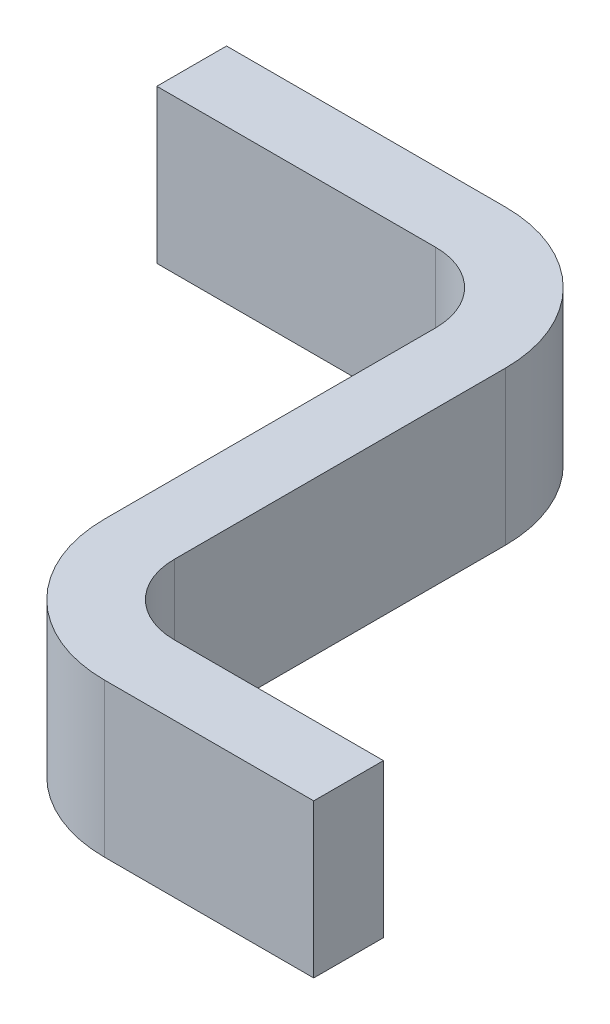
ISO-10303-21;
HEADER;
FILE_DESCRIPTION(('STEP AP214'),'2;1');
FILE_NAME('part.step','',(''),(''),'','','');
FILE_SCHEMA(('AUTOMOTIVE_DESIGN { 1 0 10303 214 1 1 1 1 }'));
ENDSEC;
DATA;
#1=APPLICATION_CONTEXT('core data for automotive mechanical design processes');
#2=APPLICATION_PROTOCOL_DEFINITION('international standard','automotive_design',2000,#1);
#3=PRODUCT_CONTEXT('',#1,'mechanical');
#4=PRODUCT('Part','Part','',(#3));
#5=PRODUCT_RELATED_PRODUCT_CATEGORY('part','',(#4));
#6=PRODUCT_DEFINITION_FORMATION('','',#4);
#7=PRODUCT_DEFINITION_CONTEXT('part definition',#1,'design');
#8=PRODUCT_DEFINITION('design','',#6,#7);
#9=PRODUCT_DEFINITION_SHAPE('','',#8);
#10=(LENGTH_UNIT() NAMED_UNIT(*) SI_UNIT(.MILLI.,.METRE.));
#11=(NAMED_UNIT(*) PLANE_ANGLE_UNIT() SI_UNIT($,.RADIAN.));
#12=(NAMED_UNIT(*) SI_UNIT($,.STERADIAN.) SOLID_ANGLE_UNIT());
#13=UNCERTAINTY_MEASURE_WITH_UNIT(LENGTH_MEASURE(1.E-05),#10,'distance_accuracy_value','');
#14=(GEOMETRIC_REPRESENTATION_CONTEXT(3) GLOBAL_UNCERTAINTY_ASSIGNED_CONTEXT((#13)) GLOBAL_UNIT_ASSIGNED_CONTEXT((#10,
#11,#12)) REPRESENTATION_CONTEXT('',''));
#15=CARTESIAN_POINT('',(0.,0.,0.));
#16=DIRECTION('',(0.,0.,1.));
#17=DIRECTION('',(1.,0.,0.));
#18=AXIS2_PLACEMENT_3D('',#15,#16,#17);
#19=CARTESIAN_POINT('',(-4.,1.36,0.675));
#20=DIRECTION('',(0.,-1.,0.));
#21=DIRECTION('',(1.,0.,0.));
#22=AXIS2_PLACEMENT_3D('',#19,#20,#21);
#23=PLANE('',#22);
#24=CARTESIAN_POINT('',(-3.8,1.36,0.675));
#25=DIRECTION('',(0.,1.,0.));
#26=DIRECTION('',(-1.,0.,0.));
#27=AXIS2_PLACEMENT_3D('',#24,#25,#26);
#28=CIRCLE('',#27,0.2);
#29=CARTESIAN_POINT('',(-3.8,1.36,0.875));
#30=VERTEX_POINT('',#29);
#31=CARTESIAN_POINT('',(-4.,1.36,0.675));
#32=VERTEX_POINT('',#31);
#33=EDGE_CURVE('E150',#30,#32,#28,.F.);
#34=ORIENTED_EDGE('',*,*,#33,.F.);
#35=DIRECTION('',(-1.,0.,0.));
#36=VECTOR('',#35,1.);
#37=CARTESIAN_POINT('',(-3.5,1.36,0.875));
#38=LINE('',#37,#36);
#39=CARTESIAN_POINT('',(-3.5,1.36,0.875));
#40=VERTEX_POINT('',#39);
#41=EDGE_CURVE('E147',#30,#40,#38,.F.);
#42=ORIENTED_EDGE('',*,*,#41,.T.);
#43=DIRECTION('',(0.,0.,1.));
#44=VECTOR('',#43,1.);
#45=CARTESIAN_POINT('',(-3.5,1.36,0.775));
#46=LINE('',#45,#44);
#47=CARTESIAN_POINT('',(-3.5,1.36,0.775));
#48=VERTEX_POINT('',#47);
#49=EDGE_CURVE('E141',#48,#40,#46,.T.);
#50=ORIENTED_EDGE('',*,*,#49,.F.);
#51=DIRECTION('',(1.,0.,0.));
#52=VECTOR('',#51,1.);
#53=CARTESIAN_POINT('',(-3.5,1.36,0.775));
#54=LINE('',#53,#52);
#55=CARTESIAN_POINT('',(-3.8,1.36,0.775));
#56=VERTEX_POINT('',#55);
#57=EDGE_CURVE('E115',#48,#56,#54,.F.);
#58=ORIENTED_EDGE('',*,*,#57,.T.);
#59=CARTESIAN_POINT('',(-3.8,1.36,0.675));
#60=DIRECTION('',(0.,1.,0.));
#61=DIRECTION('',(-1.,0.,0.));
#62=AXIS2_PLACEMENT_3D('',#59,#60,#61);
#63=CIRCLE('',#62,0.1);
#64=CARTESIAN_POINT('',(-3.9,1.36,0.675));
#65=VERTEX_POINT('',#64);
#66=EDGE_CURVE('E215',#56,#65,#63,.F.);
#67=ORIENTED_EDGE('',*,*,#66,.T.);
#68=DIRECTION('',(0.,0.,1.));
#69=VECTOR('',#68,1.);
#70=CARTESIAN_POINT('',(-3.9,1.36,0.675));
#71=LINE('',#70,#69);
#72=CARTESIAN_POINT('',(-3.9,1.36,0.2));
#73=VERTEX_POINT('',#72);
#74=EDGE_CURVE('E181',#65,#73,#71,.F.);
#75=ORIENTED_EDGE('',*,*,#74,.T.);
#76=CARTESIAN_POINT('',(-4.1,1.36,0.2));
#77=DIRECTION('',(0.,-1.,0.));
#78=DIRECTION('',(1.,0.,0.));
#79=AXIS2_PLACEMENT_3D('',#76,#77,#78);
#80=CIRCLE('',#79,0.2);
#81=CARTESIAN_POINT('',(-4.1,1.36,0.));
#82=VERTEX_POINT('',#81);
#83=EDGE_CURVE('E20',#82,#73,#80,.T.);
#84=ORIENTED_EDGE('',*,*,#83,.F.);
#85=DIRECTION('',(1.,0.,0.));
#86=VECTOR('',#85,1.);
#87=CARTESIAN_POINT('',(-4.1,1.36,0.));
#88=LINE('',#87,#86);
#89=CARTESIAN_POINT('',(-4.5,1.36,0.));
#90=VERTEX_POINT('',#89);
#91=EDGE_CURVE('E91',#82,#90,#88,.F.);
#92=ORIENTED_EDGE('',*,*,#91,.T.);
#93=DIRECTION('',(0.,0.,1.));
#94=VECTOR('',#93,1.);
#95=CARTESIAN_POINT('',(-4.5,1.36,0.));
#96=LINE('',#95,#94);
#97=CARTESIAN_POINT('',(-4.5,1.36,0.1));
#98=VERTEX_POINT('',#97);
#99=EDGE_CURVE('E163',#90,#98,#96,.T.);
#100=ORIENTED_EDGE('',*,*,#99,.T.);
#101=DIRECTION('',(-1.,0.,0.));
#102=VECTOR('',#101,1.);
#103=CARTESIAN_POINT('',(-4.1,1.36,0.1));
#104=LINE('',#103,#102);
#105=CARTESIAN_POINT('',(-4.1,1.36,0.1));
#106=VERTEX_POINT('',#105);
#107=EDGE_CURVE('E159',#98,#106,#104,.F.);
#108=ORIENTED_EDGE('',*,*,#107,.T.);
#109=CARTESIAN_POINT('',(-4.1,1.36,0.2));
#110=DIRECTION('',(0.,-1.,0.));
#111=DIRECTION('',(1.,0.,0.));
#112=AXIS2_PLACEMENT_3D('',#109,#110,#111);
#113=CIRCLE('',#112,0.1);
#114=CARTESIAN_POINT('',(-4.,1.36,0.2));
#115=VERTEX_POINT('',#114);
#116=EDGE_CURVE('E155',#106,#115,#113,.T.);
#117=ORIENTED_EDGE('',*,*,#116,.T.);
#118=DIRECTION('',(0.,0.,1.));
#119=VECTOR('',#118,1.);
#120=CARTESIAN_POINT('',(-4.,1.36,0.675));
#121=LINE('',#120,#119);
#122=EDGE_CURVE('E154',#115,#32,#121,.T.);
#123=ORIENTED_EDGE('',*,*,#122,.T.);
#124=EDGE_LOOP('',(#34,#42,#50,#58,#67,#75,#84,#92,#100,#108,#117,#123));
#125=FACE_BOUND('',#124,.T.);
#126=ADVANCED_FACE('F17',(#125),#23,.F.);
#127=CARTESIAN_POINT('',(-4.1,1.36,0.2));
#128=DIRECTION('',(0.,-1.,0.));
#129=DIRECTION('',(1.,0.,0.));
#130=AXIS2_PLACEMENT_3D('',#127,#128,#129);
#131=CYLINDRICAL_SURFACE('',#130,0.2);
#132=CARTESIAN_POINT('',(-4.1,1.14,0.2));
#133=DIRECTION('',(0.,-1.,0.));
#134=DIRECTION('',(1.,0.,0.));
#135=AXIS2_PLACEMENT_3D('',#132,#133,#134);
#136=CIRCLE('',#135,0.2);
#137=CARTESIAN_POINT('',(-3.9,1.14,0.2));
#138=VERTEX_POINT('',#137);
#139=CARTESIAN_POINT('',(-4.1,1.14,0.));
#140=VERTEX_POINT('',#139);
#141=EDGE_CURVE('E183',#138,#140,#136,.F.);
#142=ORIENTED_EDGE('',*,*,#141,.T.);
#143=DIRECTION('',(0.,1.,0.));
#144=VECTOR('',#143,1.);
#145=CARTESIAN_POINT('',(-4.1,1.36,0.));
#146=LINE('',#145,#144);
#147=EDGE_CURVE('E178',#140,#82,#146,.T.);
#148=ORIENTED_EDGE('',*,*,#147,.T.);
#149=ORIENTED_EDGE('',*,*,#83,.T.);
#150=DIRECTION('',(0.,-1.,0.));
#151=VECTOR('',#150,1.);
#152=CARTESIAN_POINT('',(-3.9,1.36,0.2));
#153=LINE('',#152,#151);
#154=EDGE_CURVE('E217',#73,#138,#153,.T.);
#155=ORIENTED_EDGE('',*,*,#154,.T.);
#156=EDGE_LOOP('',(#142,#148,#149,#155));
#157=FACE_BOUND('',#156,.T.);
#158=ADVANCED_FACE('F254',(#157),#131,.T.);
#159=CARTESIAN_POINT('',(-4.1,1.36,0.));
#160=DIRECTION('',(0.,0.,1.));
#161=DIRECTION('',(1.,0.,0.));
#162=AXIS2_PLACEMENT_3D('',#159,#160,#161);
#163=PLANE('',#162);
#164=ORIENTED_EDGE('',*,*,#147,.F.);
#165=DIRECTION('',(-1.,0.,0.));
#166=VECTOR('',#165,1.);
#167=CARTESIAN_POINT('',(-3.9,1.14,0.));
#168=LINE('',#167,#166);
#169=CARTESIAN_POINT('',(-4.5,1.14,0.));
#170=VERTEX_POINT('',#169);
#171=EDGE_CURVE('E170',#140,#170,#168,.T.);
#172=ORIENTED_EDGE('',*,*,#171,.T.);
#173=DIRECTION('',(0.,1.,0.));
#174=VECTOR('',#173,1.);
#175=CARTESIAN_POINT('',(-4.5,1.36,0.));
#176=LINE('',#175,#174);
#177=EDGE_CURVE('E173',#170,#90,#176,.T.);
#178=ORIENTED_EDGE('',*,*,#177,.T.);
#179=ORIENTED_EDGE('',*,*,#91,.F.);
#180=EDGE_LOOP('',(#164,#172,#178,#179));
#181=FACE_BOUND('',#180,.T.);
#182=ADVANCED_FACE('F257',(#181),#163,.F.);
#183=CARTESIAN_POINT('',(-4.5,1.36,0.));
#184=DIRECTION('',(1.,0.,0.));
#185=DIRECTION('',(0.,1.,0.));
#186=AXIS2_PLACEMENT_3D('',#183,#184,#185);
#187=PLANE('',#186);
#188=DIRECTION('',(0.,1.,0.));
#189=VECTOR('',#188,1.);
#190=CARTESIAN_POINT('',(-4.5,1.14,0.1));
#191=LINE('',#190,#189);
#192=CARTESIAN_POINT('',(-4.5,1.14,0.1));
#193=VERTEX_POINT('',#192);
#194=EDGE_CURVE('E160',#193,#98,#191,.T.);
#195=ORIENTED_EDGE('',*,*,#194,.T.);
#196=ORIENTED_EDGE('',*,*,#99,.F.);
#197=ORIENTED_EDGE('',*,*,#177,.F.);
#198=DIRECTION('',(0.,0.,1.));
#199=VECTOR('',#198,1.);
#200=CARTESIAN_POINT('',(-4.5,1.14,0.675));
#201=LINE('',#200,#199);
#202=EDGE_CURVE('E166',#170,#193,#201,.T.);
#203=ORIENTED_EDGE('',*,*,#202,.T.);
#204=EDGE_LOOP('',(#195,#196,#197,#203));
#205=FACE_BOUND('',#204,.T.);
#206=ADVANCED_FACE('F259',(#205),#187,.F.);
#207=CARTESIAN_POINT('',(-4.1,1.14,0.1));
#208=DIRECTION('',(0.,0.,-1.));
#209=DIRECTION('',(-1.,0.,0.));
#210=AXIS2_PLACEMENT_3D('',#207,#208,#209);
#211=PLANE('',#210);
#212=DIRECTION('',(0.,-1.,0.));
#213=VECTOR('',#212,1.);
#214=CARTESIAN_POINT('',(-4.1,1.14,0.1));
#215=LINE('',#214,#213);
#216=CARTESIAN_POINT('',(-4.1,1.14,0.1));
#217=VERTEX_POINT('',#216);
#218=EDGE_CURVE('E156',#217,#106,#215,.F.);
#219=ORIENTED_EDGE('',*,*,#218,.T.);
#220=ORIENTED_EDGE('',*,*,#107,.F.);
#221=ORIENTED_EDGE('',*,*,#194,.F.);
#222=DIRECTION('',(-1.,0.,0.));
#223=VECTOR('',#222,1.);
#224=CARTESIAN_POINT('',(-3.9,1.14,0.1));
#225=LINE('',#224,#223);
#226=EDGE_CURVE('E169',#193,#217,#225,.F.);
#227=ORIENTED_EDGE('',*,*,#226,.T.);
#228=EDGE_LOOP('',(#219,#220,#221,#227));
#229=FACE_BOUND('',#228,.T.);
#230=ADVANCED_FACE('F234',(#229),#211,.F.);
#231=CARTESIAN_POINT('',(-4.1,1.14,0.2));
#232=DIRECTION('',(0.,-1.,0.));
#233=DIRECTION('',(1.,0.,0.));
#234=AXIS2_PLACEMENT_3D('',#231,#232,#233);
#235=CYLINDRICAL_SURFACE('',#234,0.1);
#236=DIRECTION('',(0.,1.,0.));
#237=VECTOR('',#236,1.);
#238=CARTESIAN_POINT('',(-4.,1.14,0.2));
#239=LINE('',#238,#237);
#240=CARTESIAN_POINT('',(-4.,1.14,0.2));
#241=VERTEX_POINT('',#240);
#242=EDGE_CURVE('E151',#241,#115,#239,.T.);
#243=ORIENTED_EDGE('',*,*,#242,.T.);
#244=ORIENTED_EDGE('',*,*,#116,.F.);
#245=ORIENTED_EDGE('',*,*,#218,.F.);
#246=CARTESIAN_POINT('',(-4.1,1.14,0.2));
#247=DIRECTION('',(0.,-1.,0.));
#248=DIRECTION('',(1.,0.,0.));
#249=AXIS2_PLACEMENT_3D('',#246,#247,#248);
#250=CIRCLE('',#249,0.1);
#251=EDGE_CURVE('E210',#217,#241,#250,.T.);
#252=ORIENTED_EDGE('',*,*,#251,.T.);
#253=EDGE_LOOP('',(#243,#244,#245,#252));
#254=FACE_BOUND('',#253,.T.);
#255=ADVANCED_FACE('F227',(#254),#235,.F.);
#256=CARTESIAN_POINT('',(-4.,1.14,0.675));
#257=DIRECTION('',(1.,0.,0.));
#258=DIRECTION('',(0.,1.,0.));
#259=AXIS2_PLACEMENT_3D('',#256,#257,#258);
#260=PLANE('',#259);
#261=DIRECTION('',(0.,1.,0.));
#262=VECTOR('',#261,1.);
#263=CARTESIAN_POINT('',(-4.,1.14,0.675));
#264=LINE('',#263,#262);
#265=CARTESIAN_POINT('',(-4.,1.14,0.675));
#266=VERTEX_POINT('',#265);
#267=EDGE_CURVE('E148',#32,#266,#264,.F.);
#268=ORIENTED_EDGE('',*,*,#267,.F.);
#269=ORIENTED_EDGE('',*,*,#122,.F.);
#270=ORIENTED_EDGE('',*,*,#242,.F.);
#271=DIRECTION('',(0.,0.,1.));
#272=VECTOR('',#271,1.);
#273=CARTESIAN_POINT('',(-4.,1.14,0.675));
#274=LINE('',#273,#272);
#275=EDGE_CURVE('E209',#241,#266,#274,.T.);
#276=ORIENTED_EDGE('',*,*,#275,.T.);
#277=EDGE_LOOP('',(#268,#269,#270,#276));
#278=FACE_BOUND('',#277,.T.);
#279=ADVANCED_FACE('F224',(#278),#260,.F.);
#280=CARTESIAN_POINT('',(-3.80000000000001,1.14,0.675));
#281=DIRECTION('',(0.,1.,0.));
#282=DIRECTION('',(-1.,0.,0.));
#283=AXIS2_PLACEMENT_3D('',#280,#281,#282);
#284=CYLINDRICAL_SURFACE('',#283,0.2);
#285=ORIENTED_EDGE('',*,*,#33,.T.);
#286=ORIENTED_EDGE('',*,*,#267,.T.);
#287=CARTESIAN_POINT('',(-3.80000000000001,1.14,0.675));
#288=DIRECTION('',(0.,1.,0.));
#289=DIRECTION('',(-1.,0.,0.));
#290=AXIS2_PLACEMENT_3D('',#287,#288,#289);
#291=CIRCLE('',#290,0.2);
#292=CARTESIAN_POINT('',(-3.80000000000001,1.14,0.875));
#293=VERTEX_POINT('',#292);
#294=EDGE_CURVE('E133',#266,#293,#291,.T.);
#295=ORIENTED_EDGE('',*,*,#294,.T.);
#296=DIRECTION('',(0.,1.,0.));
#297=VECTOR('',#296,1.);
#298=CARTESIAN_POINT('',(-3.80000000000001,1.14,0.875));
#299=LINE('',#298,#297);
#300=EDGE_CURVE('E144',#293,#30,#299,.T.);
#301=ORIENTED_EDGE('',*,*,#300,.T.);
#302=EDGE_LOOP('',(#285,#286,#295,#301));
#303=FACE_BOUND('',#302,.T.);
#304=ADVANCED_FACE('F285',(#303),#284,.T.);
#305=CARTESIAN_POINT('',(-3.5,1.14,0.875));
#306=DIRECTION('',(0.,0.,-1.));
#307=DIRECTION('',(-1.,0.,0.));
#308=AXIS2_PLACEMENT_3D('',#305,#306,#307);
#309=PLANE('',#308);
#310=DIRECTION('',(0.,1.,0.));
#311=VECTOR('',#310,1.);
#312=CARTESIAN_POINT('',(-3.5,1.36,0.875));
#313=LINE('',#312,#311);
#314=CARTESIAN_POINT('',(-3.5,1.14,0.875));
#315=VERTEX_POINT('',#314);
#316=EDGE_CURVE('E118',#40,#315,#313,.F.);
#317=ORIENTED_EDGE('',*,*,#316,.F.);
#318=ORIENTED_EDGE('',*,*,#41,.F.);
#319=ORIENTED_EDGE('',*,*,#300,.F.);
#320=DIRECTION('',(-1.,0.,0.));
#321=VECTOR('',#320,1.);
#322=CARTESIAN_POINT('',(-3.9,1.14,0.875));
#323=LINE('',#322,#321);
#324=EDGE_CURVE('E131',#293,#315,#323,.F.);
#325=ORIENTED_EDGE('',*,*,#324,.T.);
#326=EDGE_LOOP('',(#317,#318,#319,#325));
#327=FACE_BOUND('',#326,.T.);
#328=ADVANCED_FACE('F282',(#327),#309,.F.);
#329=CARTESIAN_POINT('',(-3.5,1.36,0.775));
#330=DIRECTION('',(1.,0.,0.));
#331=DIRECTION('',(0.,1.,0.));
#332=AXIS2_PLACEMENT_3D('',#329,#330,#331);
#333=PLANE('',#332);
#334=ORIENTED_EDGE('',*,*,#49,.T.);
#335=ORIENTED_EDGE('',*,*,#316,.T.);
#336=DIRECTION('',(0.,0.,1.));
#337=VECTOR('',#336,1.);
#338=CARTESIAN_POINT('',(-3.5,1.14,0.675));
#339=LINE('',#338,#337);
#340=CARTESIAN_POINT('',(-3.5,1.14,0.775));
#341=VERTEX_POINT('',#340);
#342=EDGE_CURVE('E125',#315,#341,#339,.F.);
#343=ORIENTED_EDGE('',*,*,#342,.T.);
#344=DIRECTION('',(0.,1.,0.));
#345=VECTOR('',#344,1.);
#346=CARTESIAN_POINT('',(-3.5,1.36,0.775));
#347=LINE('',#346,#345);
#348=EDGE_CURVE('E110',#341,#48,#347,.T.);
#349=ORIENTED_EDGE('',*,*,#348,.T.);
#350=EDGE_LOOP('',(#334,#335,#343,#349));
#351=FACE_BOUND('',#350,.T.);
#352=ADVANCED_FACE('F129',(#351),#333,.T.);
#353=CARTESIAN_POINT('',(-3.5,1.36,0.775));
#354=DIRECTION('',(0.,0.,1.));
#355=DIRECTION('',(1.,0.,0.));
#356=AXIS2_PLACEMENT_3D('',#353,#354,#355);
#357=PLANE('',#356);
#358=ORIENTED_EDGE('',*,*,#348,.F.);
#359=DIRECTION('',(-1.,0.,0.));
#360=VECTOR('',#359,1.);
#361=CARTESIAN_POINT('',(-3.9,1.14,0.775));
#362=LINE('',#361,#360);
#363=CARTESIAN_POINT('',(-3.80000000000001,1.14,0.775));
#364=VERTEX_POINT('',#363);
#365=EDGE_CURVE('E114',#341,#364,#362,.T.);
#366=ORIENTED_EDGE('',*,*,#365,.T.);
#367=DIRECTION('',(0.,1.,0.));
#368=VECTOR('',#367,1.);
#369=CARTESIAN_POINT('',(-3.8,1.36,0.775));
#370=LINE('',#369,#368);
#371=EDGE_CURVE('E185',#364,#56,#370,.T.);
#372=ORIENTED_EDGE('',*,*,#371,.T.);
#373=ORIENTED_EDGE('',*,*,#57,.F.);
#374=EDGE_LOOP('',(#358,#366,#372,#373));
#375=FACE_BOUND('',#374,.T.);
#376=ADVANCED_FACE('F112',(#375),#357,.F.);
#377=CARTESIAN_POINT('',(-3.8,1.36,0.675));
#378=DIRECTION('',(0.,1.,0.));
#379=DIRECTION('',(-1.,0.,0.));
#380=AXIS2_PLACEMENT_3D('',#377,#378,#379);
#381=CYLINDRICAL_SURFACE('',#380,0.1);
#382=ORIENTED_EDGE('',*,*,#371,.F.);
#383=CARTESIAN_POINT('',(-3.80000000000001,1.14,0.675));
#384=DIRECTION('',(0.,1.,0.));
#385=DIRECTION('',(-1.,0.,0.));
#386=AXIS2_PLACEMENT_3D('',#383,#384,#385);
#387=CIRCLE('',#386,0.1);
#388=CARTESIAN_POINT('',(-3.9,1.14,0.675));
#389=VERTEX_POINT('',#388);
#390=EDGE_CURVE('E26',#364,#389,#387,.F.);
#391=ORIENTED_EDGE('',*,*,#390,.T.);
#392=DIRECTION('',(0.,-1.,0.));
#393=VECTOR('',#392,1.);
#394=CARTESIAN_POINT('',(-3.9,1.36,0.675));
#395=LINE('',#394,#393);
#396=EDGE_CURVE('E34',#389,#65,#395,.F.);
#397=ORIENTED_EDGE('',*,*,#396,.T.);
#398=ORIENTED_EDGE('',*,*,#66,.F.);
#399=EDGE_LOOP('',(#382,#391,#397,#398));
#400=FACE_BOUND('',#399,.T.);
#401=ADVANCED_FACE('F250',(#400),#381,.F.);
#402=CARTESIAN_POINT('',(-3.9,1.36,0.675));
#403=DIRECTION('',(-1.,0.,0.));
#404=DIRECTION('',(0.,-1.,0.));
#405=AXIS2_PLACEMENT_3D('',#402,#403,#404);
#406=PLANE('',#405);
#407=ORIENTED_EDGE('',*,*,#396,.F.);
#408=DIRECTION('',(0.,0.,1.));
#409=VECTOR('',#408,1.);
#410=CARTESIAN_POINT('',(-3.9,1.14,0.675));
#411=LINE('',#410,#409);
#412=EDGE_CURVE('E11',#389,#138,#411,.F.);
#413=ORIENTED_EDGE('',*,*,#412,.T.);
#414=ORIENTED_EDGE('',*,*,#154,.F.);
#415=ORIENTED_EDGE('',*,*,#74,.F.);
#416=EDGE_LOOP('',(#407,#413,#414,#415));
#417=FACE_BOUND('',#416,.T.);
#418=ADVANCED_FACE('F252',(#417),#406,.F.);
#419=CARTESIAN_POINT('',(-3.9,1.14,0.675));
#420=DIRECTION('',(0.,1.,0.));
#421=DIRECTION('',(-1.,0.,0.));
#422=AXIS2_PLACEMENT_3D('',#419,#420,#421);
#423=PLANE('',#422);
#424=ORIENTED_EDGE('',*,*,#390,.F.);
#425=ORIENTED_EDGE('',*,*,#365,.F.);
#426=ORIENTED_EDGE('',*,*,#342,.F.);
#427=ORIENTED_EDGE('',*,*,#324,.F.);
#428=ORIENTED_EDGE('',*,*,#294,.F.);
#429=ORIENTED_EDGE('',*,*,#275,.F.);
#430=ORIENTED_EDGE('',*,*,#251,.F.);
#431=ORIENTED_EDGE('',*,*,#226,.F.);
#432=ORIENTED_EDGE('',*,*,#202,.F.);
#433=ORIENTED_EDGE('',*,*,#171,.F.);
#434=ORIENTED_EDGE('',*,*,#141,.F.);
#435=ORIENTED_EDGE('',*,*,#412,.F.);
#436=EDGE_LOOP('',(#424,#425,#426,#427,#428,#429,#430,#431,#432,#433,#434,#435));
#437=FACE_BOUND('',#436,.T.);
#438=ADVANCED_FACE('F123',(#437),#423,.F.);
#439=CLOSED_SHELL('',(#126,#158,#182,#206,#230,#255,#279,#304,#328,#352,#376,#401,#418,#438));
#440=MANIFOLD_SOLID_BREP('B1',#439);
#441=ADVANCED_BREP_SHAPE_REPRESENTATION('',(#18,#440),#14);
#442=SHAPE_DEFINITION_REPRESENTATION(#9,#441);
ENDSEC;
END-ISO-10303-21;
